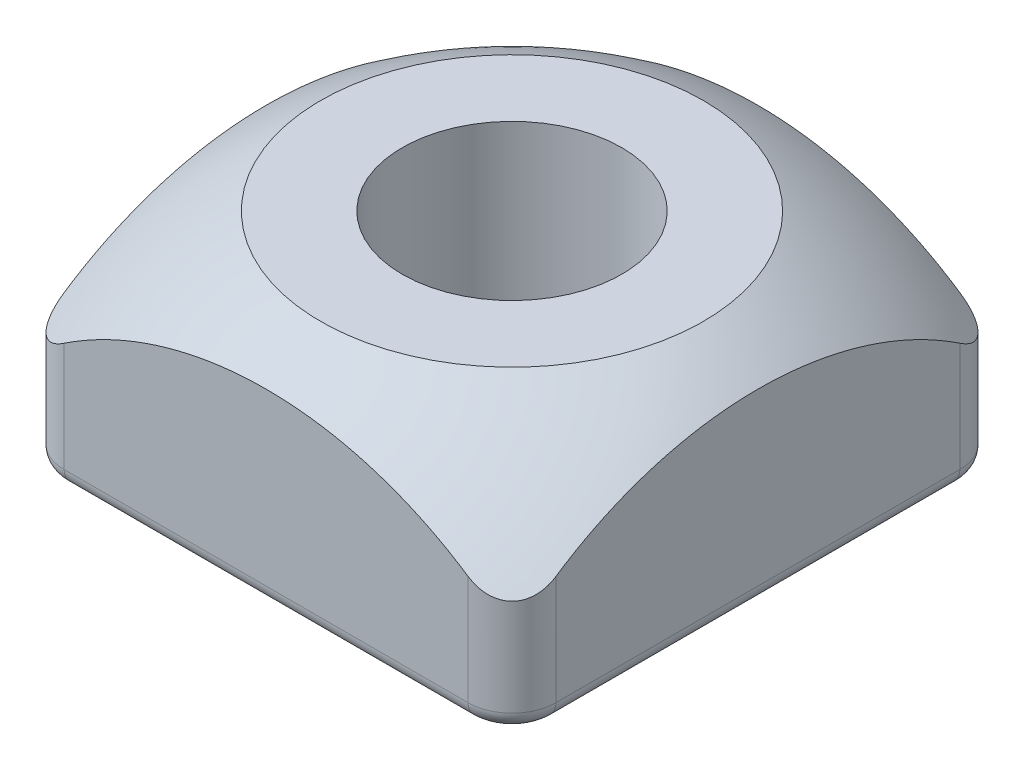
ISO-10303-21;
HEADER;
FILE_DESCRIPTION(('STEP AP214'),'2;1');
FILE_NAME('part.step','',(''),(''),'','','');
FILE_SCHEMA(('AUTOMOTIVE_DESIGN { 1 0 10303 214 1 1 1 1 }'));
ENDSEC;
DATA;
#1=APPLICATION_CONTEXT('core data for automotive mechanical design processes');
#2=APPLICATION_PROTOCOL_DEFINITION('international standard','automotive_design',2000,#1);
#3=PRODUCT_CONTEXT('',#1,'mechanical');
#4=PRODUCT('Part','Part','',(#3));
#5=PRODUCT_RELATED_PRODUCT_CATEGORY('part','',(#4));
#6=PRODUCT_DEFINITION_FORMATION('','',#4);
#7=PRODUCT_DEFINITION_CONTEXT('part definition',#1,'design');
#8=PRODUCT_DEFINITION('design','',#6,#7);
#9=PRODUCT_DEFINITION_SHAPE('','',#8);
#10=(LENGTH_UNIT() NAMED_UNIT(*) SI_UNIT(.MILLI.,.METRE.));
#11=(NAMED_UNIT(*) PLANE_ANGLE_UNIT() SI_UNIT($,.RADIAN.));
#12=(NAMED_UNIT(*) SI_UNIT($,.STERADIAN.) SOLID_ANGLE_UNIT());
#13=UNCERTAINTY_MEASURE_WITH_UNIT(LENGTH_MEASURE(1.E-05),#10,'distance_accuracy_value','');
#14=(GEOMETRIC_REPRESENTATION_CONTEXT(3) GLOBAL_UNCERTAINTY_ASSIGNED_CONTEXT((#13)) GLOBAL_UNIT_ASSIGNED_CONTEXT((#10,
#11,#12)) REPRESENTATION_CONTEXT('',''));
#15=CARTESIAN_POINT('',(0.,0.,0.));
#16=DIRECTION('',(0.,0.,1.));
#17=DIRECTION('',(1.,0.,0.));
#18=AXIS2_PLACEMENT_3D('',#15,#16,#17);
#19=CARTESIAN_POINT('',(-2.8,2.5,2.8));
#20=DIRECTION('',(1.,0.,0.));
#21=DIRECTION('',(0.,0.,-1.));
#22=AXIS2_PLACEMENT_3D('',#19,#20,#21);
#23=PLANE('',#22);
#24=DIRECTION('',(0.,1.,0.));
#25=VECTOR('',#24,1.);
#26=CARTESIAN_POINT('',(-2.8,2.5,-2.3));
#27=LINE('',#26,#25);
#28=CARTESIAN_POINT('',(-2.8,1.44528663539044,-2.3));
#29=VERTEX_POINT('',#28);
#30=CARTESIAN_POINT('',(-2.8,0.2,-2.3));
#31=VERTEX_POINT('',#30);
#32=EDGE_CURVE('E261',#29,#31,#27,.F.);
#33=ORIENTED_EDGE('',*,*,#32,.T.);
#34=DIRECTION('',(0.,0.,-1.));
#35=VECTOR('',#34,1.);
#36=CARTESIAN_POINT('',(-2.8,0.2,2.8));
#37=LINE('',#36,#35);
#38=CARTESIAN_POINT('',(-2.8,0.2,2.3));
#39=VERTEX_POINT('',#38);
#40=EDGE_CURVE('E289',#31,#39,#37,.F.);
#41=ORIENTED_EDGE('',*,*,#40,.T.);
#42=DIRECTION('',(0.,1.,0.));
#43=VECTOR('',#42,1.);
#44=CARTESIAN_POINT('',(-2.8,2.5,2.3));
#45=LINE('',#44,#43);
#46=CARTESIAN_POINT('',(-2.8,1.44528663539044,2.3));
#47=VERTEX_POINT('',#46);
#48=EDGE_CURVE('E263',#39,#47,#45,.T.);
#49=ORIENTED_EDGE('',*,*,#48,.T.);
#50=CARTESIAN_POINT('',(-2.8,-2.,0.));
#51=DIRECTION('',(1.,0.,0.));
#52=DIRECTION('',(0.,0.,-1.));
#53=AXIS2_PLACEMENT_3D('',#50,#51,#52);
#54=CIRCLE('',#53,4.14246303544159);
#55=EDGE_CURVE('E145',#29,#47,#54,.T.);
#56=ORIENTED_EDGE('',*,*,#55,.F.);
#57=EDGE_LOOP('',(#33,#41,#49,#56));
#58=FACE_BOUND('',#57,.T.);
#59=ADVANCED_FACE('F47',(#58),#23,.F.);
#60=CARTESIAN_POINT('',(2.8,2.5,2.8));
#61=DIRECTION('',(0.,0.,-1.));
#62=DIRECTION('',(-1.,0.,0.));
#63=AXIS2_PLACEMENT_3D('',#60,#61,#62);
#64=PLANE('',#63);
#65=DIRECTION('',(0.,1.,0.));
#66=VECTOR('',#65,1.);
#67=CARTESIAN_POINT('',(-2.3,2.5,2.8));
#68=LINE('',#67,#66);
#69=CARTESIAN_POINT('',(-2.3,1.44528663539044,2.8));
#70=VERTEX_POINT('',#69);
#71=CARTESIAN_POINT('',(-2.3,0.2,2.8));
#72=VERTEX_POINT('',#71);
#73=EDGE_CURVE('E155',#70,#72,#68,.F.);
#74=ORIENTED_EDGE('',*,*,#73,.T.);
#75=DIRECTION('',(-1.,0.,0.));
#76=VECTOR('',#75,1.);
#77=CARTESIAN_POINT('',(2.8,0.2,2.8));
#78=LINE('',#77,#76);
#79=CARTESIAN_POINT('',(2.3,0.2,2.8));
#80=VERTEX_POINT('',#79);
#81=EDGE_CURVE('E287',#72,#80,#78,.F.);
#82=ORIENTED_EDGE('',*,*,#81,.T.);
#83=DIRECTION('',(0.,1.,0.));
#84=VECTOR('',#83,1.);
#85=CARTESIAN_POINT('',(2.3,2.5,2.8));
#86=LINE('',#85,#84);
#87=CARTESIAN_POINT('',(2.3,1.44528663539044,2.8));
#88=VERTEX_POINT('',#87);
#89=EDGE_CURVE('E157',#80,#88,#86,.T.);
#90=ORIENTED_EDGE('',*,*,#89,.T.);
#91=CARTESIAN_POINT('',(0.,-2.,2.8));
#92=DIRECTION('',(0.,0.,-1.));
#93=DIRECTION('',(-1.,0.,0.));
#94=AXIS2_PLACEMENT_3D('',#91,#92,#93);
#95=CIRCLE('',#94,4.14246303544159);
#96=EDGE_CURVE('E143',#70,#88,#95,.T.);
#97=ORIENTED_EDGE('',*,*,#96,.F.);
#98=EDGE_LOOP('',(#74,#82,#90,#97));
#99=FACE_BOUND('',#98,.T.);
#100=ADVANCED_FACE('F154',(#99),#64,.F.);
#101=CARTESIAN_POINT('',(2.8,2.5,2.8));
#102=DIRECTION('',(-1.,0.,0.));
#103=DIRECTION('',(0.,0.,1.));
#104=AXIS2_PLACEMENT_3D('',#101,#102,#103);
#105=PLANE('',#104);
#106=DIRECTION('',(0.,1.,0.));
#107=VECTOR('',#106,1.);
#108=CARTESIAN_POINT('',(2.8,2.5,2.3));
#109=LINE('',#108,#107);
#110=CARTESIAN_POINT('',(2.8,1.44528663539044,2.3));
#111=VERTEX_POINT('',#110);
#112=CARTESIAN_POINT('',(2.8,0.2,2.3));
#113=VERTEX_POINT('',#112);
#114=EDGE_CURVE('E259',#111,#113,#109,.F.);
#115=ORIENTED_EDGE('',*,*,#114,.T.);
#116=DIRECTION('',(0.,0.,1.));
#117=VECTOR('',#116,1.);
#118=CARTESIAN_POINT('',(2.8,0.2,2.8));
#119=LINE('',#118,#117);
#120=CARTESIAN_POINT('',(2.8,0.2,-2.3));
#121=VERTEX_POINT('',#120);
#122=EDGE_CURVE('E70',#113,#121,#119,.F.);
#123=ORIENTED_EDGE('',*,*,#122,.T.);
#124=DIRECTION('',(0.,1.,0.));
#125=VECTOR('',#124,1.);
#126=CARTESIAN_POINT('',(2.8,2.5,-2.3));
#127=LINE('',#126,#125);
#128=CARTESIAN_POINT('',(2.8,1.44528663539044,-2.3));
#129=VERTEX_POINT('',#128);
#130=EDGE_CURVE('E253',#121,#129,#127,.T.);
#131=ORIENTED_EDGE('',*,*,#130,.T.);
#132=CARTESIAN_POINT('',(2.8,-2.,0.));
#133=DIRECTION('',(-1.,0.,0.));
#134=DIRECTION('',(0.,0.,1.));
#135=AXIS2_PLACEMENT_3D('',#132,#133,#134);
#136=CIRCLE('',#135,4.14246303544159);
#137=EDGE_CURVE('E161',#111,#129,#136,.T.);
#138=ORIENTED_EDGE('',*,*,#137,.F.);
#139=EDGE_LOOP('',(#115,#123,#131,#138));
#140=FACE_BOUND('',#139,.T.);
#141=ADVANCED_FACE('F236',(#140),#105,.F.);
#142=CARTESIAN_POINT('',(2.8,2.5,-2.8));
#143=DIRECTION('',(0.,0.,1.));
#144=DIRECTION('',(1.,0.,0.));
#145=AXIS2_PLACEMENT_3D('',#142,#143,#144);
#146=PLANE('',#145);
#147=DIRECTION('',(0.,1.,0.));
#148=VECTOR('',#147,1.);
#149=CARTESIAN_POINT('',(2.3,2.5,-2.8));
#150=LINE('',#149,#148);
#151=CARTESIAN_POINT('',(2.3,1.44528663539044,-2.8));
#152=VERTEX_POINT('',#151);
#153=CARTESIAN_POINT('',(2.3,0.2,-2.8));
#154=VERTEX_POINT('',#153);
#155=EDGE_CURVE('E267',#152,#154,#150,.F.);
#156=ORIENTED_EDGE('',*,*,#155,.T.);
#157=DIRECTION('',(1.,0.,0.));
#158=VECTOR('',#157,1.);
#159=CARTESIAN_POINT('',(2.8,0.2,-2.8));
#160=LINE('',#159,#158);
#161=CARTESIAN_POINT('',(-2.3,0.2,-2.8));
#162=VERTEX_POINT('',#161);
#163=EDGE_CURVE('E56',#154,#162,#160,.F.);
#164=ORIENTED_EDGE('',*,*,#163,.T.);
#165=DIRECTION('',(0.,1.,0.));
#166=VECTOR('',#165,1.);
#167=CARTESIAN_POINT('',(-2.3,2.5,-2.8));
#168=LINE('',#167,#166);
#169=CARTESIAN_POINT('',(-2.3,1.44528663539044,-2.8));
#170=VERTEX_POINT('',#169);
#171=EDGE_CURVE('E265',#162,#170,#168,.T.);
#172=ORIENTED_EDGE('',*,*,#171,.T.);
#173=CARTESIAN_POINT('',(0.,-2.,-2.8));
#174=DIRECTION('',(0.,0.,1.));
#175=DIRECTION('',(1.,0.,0.));
#176=AXIS2_PLACEMENT_3D('',#173,#174,#175);
#177=CIRCLE('',#176,4.14246303544159);
#178=EDGE_CURVE('E160',#152,#170,#177,.T.);
#179=ORIENTED_EDGE('',*,*,#178,.F.);
#180=EDGE_LOOP('',(#156,#164,#172,#179));
#181=FACE_BOUND('',#180,.T.);
#182=ADVANCED_FACE('F462',(#181),#146,.F.);
#183=CARTESIAN_POINT('',(0.,2.5,0.));
#184=DIRECTION('',(0.,1.,0.));
#185=DIRECTION('',(0.,0.,1.));
#186=AXIS2_PLACEMENT_3D('',#183,#184,#185);
#187=PLANE('',#186);
#188=CARTESIAN_POINT('',(0.,2.5,0.));
#189=DIRECTION('',(0.,-1.,0.));
#190=DIRECTION('',(0.,0.,-1.));
#191=AXIS2_PLACEMENT_3D('',#188,#189,#190);
#192=CIRCLE('',#191,1.24999999999999);
#193=CARTESIAN_POINT('',(0.,2.5,-1.24999999999999));
#194=VERTEX_POINT('',#193);
#195=EDGE_CURVE('E321',#194,#194,#192,.T.);
#196=ORIENTED_EDGE('',*,*,#195,.T.);
#197=EDGE_LOOP('',(#196));
#198=FACE_BOUND('',#197,.T.);
#199=CARTESIAN_POINT('',(0.,2.5,0.));
#200=DIRECTION('',(0.,-1.,0.));
#201=DIRECTION('',(0.,0.,-1.));
#202=AXIS2_PLACEMENT_3D('',#199,#200,#201);
#203=CIRCLE('',#202,2.17944947177034);
#204=CARTESIAN_POINT('',(0.,2.5,-2.17944947177034));
#205=VERTEX_POINT('',#204);
#206=EDGE_CURVE('E326',#205,#205,#203,.T.);
#207=ORIENTED_EDGE('',*,*,#206,.F.);
#208=EDGE_LOOP('',(#207));
#209=FACE_BOUND('',#208,.T.);
#210=ADVANCED_FACE('F476',(#198,#209),#187,.T.);
#211=CARTESIAN_POINT('',(0.,-2.,0.));
#212=DIRECTION('',(0.,-1.,0.));
#213=DIRECTION('',(-1.,0.,0.));
#214=AXIS2_PLACEMENT_3D('',#211,#212,#213);
#215=SPHERICAL_SURFACE('',#214,5.);
#216=ORIENTED_EDGE('',*,*,#96,.T.);
#217=CARTESIAN_POINT('',(2.3,1.44528663539044,2.8));
#218=CARTESIAN_POINT('',(2.32389359725435,1.42933958153023,2.80000165895995));
#219=CARTESIAN_POINT('',(2.34836510803107,1.41403368764153,2.79828407998937));
#220=CARTESIAN_POINT('',(2.39812554004884,1.3853438352269,2.7909280072133));
#221=CARTESIAN_POINT('',(2.42341990628143,1.37197883051124,2.78525362782335));
#222=CARTESIAN_POINT('',(2.46899510909595,1.35050350313217,2.77105264297867));
#223=CARTESIAN_POINT('',(2.48927254944037,1.34187675888602,2.76331774108007));
#224=CARTESIAN_POINT('',(2.52928038952523,1.32700191940263,2.7448746651823));
#225=CARTESIAN_POINT('',(2.54901238083583,1.32074602832124,2.7341764396475));
#226=CARTESIAN_POINT('',(2.58750775871995,1.3110146308646,2.70971109185568));
#227=CARTESIAN_POINT('',(2.60626093727182,1.30756441903974,2.6959174504787));
#228=CARTESIAN_POINT('',(2.64183331135255,1.30387866373953,2.66564268820175));
#229=CARTESIAN_POINT('',(2.65865242937235,1.30364324905534,2.64916145965846));
#230=CARTESIAN_POINT('',(2.68769297476113,1.30622983881792,2.61640378531577));
#231=CARTESIAN_POINT('',(2.70022729277496,1.30866485215151,2.60037048452868));
#232=CARTESIAN_POINT('',(2.72305241876439,1.31580315380173,2.56726541690732));
#233=CARTESIAN_POINT('',(2.73334390460875,1.32050575538308,2.5501939658421));
#234=CARTESIAN_POINT('',(2.75188517444051,1.3320471112171,2.51496177736431));
#235=CARTESIAN_POINT('',(2.7600632686286,1.3389465355861,2.49678370029081));
#236=CARTESIAN_POINT('',(2.77403958329794,1.35446939746574,2.4602203116725));
#237=CARTESIAN_POINT('',(2.77983306810354,1.36309621547004,2.44183466154758));
#238=CARTESIAN_POINT('',(2.78986169901074,1.38308201829933,2.40250109296047));
#239=CARTESIAN_POINT('',(2.7937418614401,1.39465625733277,2.38157444174607));
#240=CARTESIAN_POINT('',(2.79880266262894,1.41909964886847,2.34030825314171));
#241=CARTESIAN_POINT('',(2.79999848070943,1.43196108831276,2.31996605987963));
#242=CARTESIAN_POINT('',(2.8,1.44528663539044,2.3));
#243=B_SPLINE_CURVE_WITH_KNOTS('',3,(#217,#218,#219,#220,#221,#222,#223,#224,#225,#226,#227,
#228,#229,#230,#231,#232,#233,#234,#235,#236,#237,#238,#239,#240,#241,#242),.UNSPECIFIED.,.F.,
.F.,(4,2,2,2,2,2,2,2,2,2,2,2,4),(0.,0.0863152448825878,0.173423669988819,0.243207755587152,
0.312760343894302,0.382933239318148,0.45310894599913,0.514313904285934,0.575500338384604,
0.638549387743397,0.701723051120375,0.774197114745059,0.846260311432706),.UNSPECIFIED.);
#244=EDGE_CURVE('E149',#88,#111,#243,.T.);
#245=ORIENTED_EDGE('',*,*,#244,.T.);
#246=ORIENTED_EDGE('',*,*,#137,.T.);
#247=CARTESIAN_POINT('',(2.8,1.44528663539044,-2.3));
#248=CARTESIAN_POINT('',(2.80000165895995,1.42933958153023,-2.32389359725435));
#249=CARTESIAN_POINT('',(2.79828407998937,1.41403368764153,-2.34836510803107));
#250=CARTESIAN_POINT('',(2.7909280072133,1.3853438352269,-2.39812554004884));
#251=CARTESIAN_POINT('',(2.78525362782335,1.37197883051124,-2.42341990628143));
#252=CARTESIAN_POINT('',(2.77105264297867,1.35050350313217,-2.46899510909595));
#253=CARTESIAN_POINT('',(2.76331774108007,1.34187675888602,-2.48927254944037));
#254=CARTESIAN_POINT('',(2.7448746651823,1.32700191940263,-2.52928038952523));
#255=CARTESIAN_POINT('',(2.7341764396475,1.32074602832123,-2.54901238083583));
#256=CARTESIAN_POINT('',(2.70971109185568,1.3110146308646,-2.58750775871995));
#257=CARTESIAN_POINT('',(2.6959174504787,1.30756441903974,-2.60626093727182));
#258=CARTESIAN_POINT('',(2.66564268820175,1.30387866373953,-2.64183331135255));
#259=CARTESIAN_POINT('',(2.64916145965846,1.30364324905534,-2.65865242937235));
#260=CARTESIAN_POINT('',(2.61640378531577,1.30622983881792,-2.68769297476113));
#261=CARTESIAN_POINT('',(2.60037048452868,1.30866485215151,-2.70022729277496));
#262=CARTESIAN_POINT('',(2.56726541690732,1.31580315380173,-2.72305241876439));
#263=CARTESIAN_POINT('',(2.5501939658421,1.32050575538308,-2.73334390460875));
#264=CARTESIAN_POINT('',(2.51496177736431,1.3320471112171,-2.75188517444051));
#265=CARTESIAN_POINT('',(2.49678370029081,1.3389465355861,-2.7600632686286));
#266=CARTESIAN_POINT('',(2.4602203116725,1.35446939746574,-2.77403958329794));
#267=CARTESIAN_POINT('',(2.44183466154758,1.36309621547004,-2.77983306810354));
#268=CARTESIAN_POINT('',(2.40250109296047,1.38308201829933,-2.78986169901074));
#269=CARTESIAN_POINT('',(2.38157444174607,1.39465625733277,-2.7937418614401));
#270=CARTESIAN_POINT('',(2.34030825314171,1.41909964886847,-2.79880266262894));
#271=CARTESIAN_POINT('',(2.31996605987963,1.43196108831276,-2.79999848070943));
#272=CARTESIAN_POINT('',(2.3,1.44528663539044,-2.8));
#273=B_SPLINE_CURVE_WITH_KNOTS('',3,(#247,#248,#249,#250,#251,#252,#253,#254,#255,#256,#257,
#258,#259,#260,#261,#262,#263,#264,#265,#266,#267,#268,#269,#270,#271,#272),.UNSPECIFIED.,.F.,
.F.,(4,2,2,2,2,2,2,2,2,2,2,2,4),(0.,0.0863152448825873,0.173423669988819,0.243207755587152,
0.312760343894301,0.382933239318147,0.453108945999129,0.514313904285933,0.575500338384603,
0.638549387743396,0.701723051120374,0.774197114745059,0.846260311432707),.UNSPECIFIED.);
#274=EDGE_CURVE('E150',#129,#152,#273,.T.);
#275=ORIENTED_EDGE('',*,*,#274,.T.);
#276=ORIENTED_EDGE('',*,*,#178,.T.);
#277=CARTESIAN_POINT('',(-2.3,1.44528663539044,-2.8));
#278=CARTESIAN_POINT('',(-2.32389359725435,1.42933958153023,-2.80000165895995));
#279=CARTESIAN_POINT('',(-2.34836510803107,1.41403368764153,-2.79828407998937));
#280=CARTESIAN_POINT('',(-2.39812554004884,1.3853438352269,-2.7909280072133));
#281=CARTESIAN_POINT('',(-2.42341990628143,1.37197883051123,-2.78525362782335));
#282=CARTESIAN_POINT('',(-2.46899510909595,1.35050350313216,-2.77105264297867));
#283=CARTESIAN_POINT('',(-2.48927254944037,1.34187675888602,-2.76331774108007));
#284=CARTESIAN_POINT('',(-2.52928038952523,1.32700191940263,-2.7448746651823));
#285=CARTESIAN_POINT('',(-2.54901238083583,1.32074602832123,-2.7341764396475));
#286=CARTESIAN_POINT('',(-2.58750775871995,1.3110146308646,-2.70971109185568));
#287=CARTESIAN_POINT('',(-2.60626093727182,1.30756441903974,-2.6959174504787));
#288=CARTESIAN_POINT('',(-2.64183331135255,1.30387866373953,-2.66564268820175));
#289=CARTESIAN_POINT('',(-2.65865242937235,1.30364324905534,-2.64916145965846));
#290=CARTESIAN_POINT('',(-2.68769297476113,1.30622983881792,-2.61640378531577));
#291=CARTESIAN_POINT('',(-2.70022729277496,1.30866485215151,-2.60037048452868));
#292=CARTESIAN_POINT('',(-2.72305241876439,1.31580315380173,-2.56726541690732));
#293=CARTESIAN_POINT('',(-2.73334390460875,1.32050575538307,-2.5501939658421));
#294=CARTESIAN_POINT('',(-2.75188517444051,1.3320471112171,-2.51496177736431));
#295=CARTESIAN_POINT('',(-2.7600632686286,1.3389465355861,-2.49678370029081));
#296=CARTESIAN_POINT('',(-2.77403958329794,1.35446939746574,-2.4602203116725));
#297=CARTESIAN_POINT('',(-2.77983306810354,1.36309621547004,-2.44183466154758));
#298=CARTESIAN_POINT('',(-2.78986169901074,1.38308201829933,-2.40250109296047));
#299=CARTESIAN_POINT('',(-2.7937418614401,1.39465625733277,-2.38157444174607));
#300=CARTESIAN_POINT('',(-2.79880266262894,1.41909964886847,-2.3403082531417));
#301=CARTESIAN_POINT('',(-2.79999848070943,1.43196108831276,-2.31996605987963));
#302=CARTESIAN_POINT('',(-2.8,1.44528663539044,-2.3));
#303=B_SPLINE_CURVE_WITH_KNOTS('',3,(#277,#278,#279,#280,#281,#282,#283,#284,#285,#286,#287,
#288,#289,#290,#291,#292,#293,#294,#295,#296,#297,#298,#299,#300,#301,#302),.UNSPECIFIED.,.F.,
.F.,(4,2,2,2,2,2,2,2,2,2,2,2,4),(0.,0.0863152448825873,0.173423669988819,0.243207755587152,
0.312760343894301,0.382933239318147,0.453108945999129,0.514313904285933,0.575500338384603,
0.638549387743396,0.701723051120374,0.774197114745059,0.846260311432707),.UNSPECIFIED.);
#304=EDGE_CURVE('E168',#170,#29,#303,.T.);
#305=ORIENTED_EDGE('',*,*,#304,.T.);
#306=ORIENTED_EDGE('',*,*,#55,.T.);
#307=CARTESIAN_POINT('',(-2.8,1.44528663539044,2.3));
#308=CARTESIAN_POINT('',(-2.80000165895995,1.42933958153023,2.32389359725435));
#309=CARTESIAN_POINT('',(-2.79828407998937,1.41403368764153,2.34836510803107));
#310=CARTESIAN_POINT('',(-2.7909280072133,1.3853438352269,2.39812554004884));
#311=CARTESIAN_POINT('',(-2.78525362782335,1.37197883051123,2.42341990628143));
#312=CARTESIAN_POINT('',(-2.77105264297867,1.35050350313216,2.46899510909595));
#313=CARTESIAN_POINT('',(-2.76331774108007,1.34187675888602,2.48927254944037));
#314=CARTESIAN_POINT('',(-2.7448746651823,1.32700191940263,2.52928038952523));
#315=CARTESIAN_POINT('',(-2.7341764396475,1.32074602832123,2.54901238083583));
#316=CARTESIAN_POINT('',(-2.70971109185568,1.3110146308646,2.58750775871995));
#317=CARTESIAN_POINT('',(-2.6959174504787,1.30756441903973,2.60626093727182));
#318=CARTESIAN_POINT('',(-2.66564268820175,1.30387866373953,2.64183331135255));
#319=CARTESIAN_POINT('',(-2.64916145965846,1.30364324905534,2.65865242937235));
#320=CARTESIAN_POINT('',(-2.61640378531577,1.30622983881792,2.68769297476113));
#321=CARTESIAN_POINT('',(-2.60037048452868,1.30866485215151,2.70022729277496));
#322=CARTESIAN_POINT('',(-2.56726541690733,1.31580315380173,2.72305241876439));
#323=CARTESIAN_POINT('',(-2.5501939658421,1.32050575538307,2.73334390460875));
#324=CARTESIAN_POINT('',(-2.51496177736431,1.3320471112171,2.75188517444051));
#325=CARTESIAN_POINT('',(-2.49678370029081,1.3389465355861,2.7600632686286));
#326=CARTESIAN_POINT('',(-2.4602203116725,1.35446939746573,2.77403958329794));
#327=CARTESIAN_POINT('',(-2.44183466154758,1.36309621547004,2.77983306810354));
#328=CARTESIAN_POINT('',(-2.40250109296047,1.38308201829933,2.78986169901074));
#329=CARTESIAN_POINT('',(-2.38157444174607,1.39465625733276,2.7937418614401));
#330=CARTESIAN_POINT('',(-2.34030825314171,1.41909964886847,2.79880266262894));
#331=CARTESIAN_POINT('',(-2.31996605987963,1.43196108831276,2.79999848070943));
#332=CARTESIAN_POINT('',(-2.3,1.44528663539044,2.8));
#333=B_SPLINE_CURVE_WITH_KNOTS('',3,(#307,#308,#309,#310,#311,#312,#313,#314,#315,#316,#317,
#318,#319,#320,#321,#322,#323,#324,#325,#326,#327,#328,#329,#330,#331,#332),.UNSPECIFIED.,.F.,
.F.,(4,2,2,2,2,2,2,2,2,2,2,2,4),(0.,0.0863152448825876,0.17342366998882,0.243207755587151,
0.312760343894302,0.382933239318148,0.453108945999129,0.514313904285933,0.575500338384604,
0.638549387743397,0.701723051120375,0.774197114745059,0.846260311432707),.UNSPECIFIED.);
#334=EDGE_CURVE('E139',#47,#70,#333,.T.);
#335=ORIENTED_EDGE('',*,*,#334,.T.);
#336=EDGE_LOOP('',(#216,#245,#246,#275,#276,#305,#306,#335));
#337=FACE_BOUND('',#336,.T.);
#338=ORIENTED_EDGE('',*,*,#206,.T.);
#339=EDGE_LOOP('',(#338));
#340=FACE_BOUND('',#339,.T.);
#341=ADVANCED_FACE('F141',(#337,#340),#215,.T.);
#342=CARTESIAN_POINT('',(0.,0.,0.));
#343=DIRECTION('',(0.,1.,0.));
#344=DIRECTION('',(0.,0.,1.));
#345=AXIS2_PLACEMENT_3D('',#342,#343,#344);
#346=PLANE('',#345);
#347=DIRECTION('',(-1.,0.,0.));
#348=VECTOR('',#347,1.);
#349=CARTESIAN_POINT('',(0.,0.,2.6));
#350=LINE('',#349,#348);
#351=CARTESIAN_POINT('',(2.3,0.,2.6));
#352=VERTEX_POINT('',#351);
#353=CARTESIAN_POINT('',(-2.3,0.,2.6));
#354=VERTEX_POINT('',#353);
#355=EDGE_CURVE('E281',#352,#354,#350,.T.);
#356=ORIENTED_EDGE('',*,*,#355,.T.);
#357=CARTESIAN_POINT('',(-2.3,0.,2.3));
#358=DIRECTION('',(0.,1.,0.));
#359=DIRECTION('',(0.,0.,1.));
#360=AXIS2_PLACEMENT_3D('',#357,#358,#359);
#361=CIRCLE('',#360,0.3);
#362=CARTESIAN_POINT('',(-2.6,0.,2.3));
#363=VERTEX_POINT('',#362);
#364=EDGE_CURVE('E283',#354,#363,#361,.F.);
#365=ORIENTED_EDGE('',*,*,#364,.T.);
#366=DIRECTION('',(0.,0.,-1.));
#367=VECTOR('',#366,1.);
#368=CARTESIAN_POINT('',(-2.6,0.,0.));
#369=LINE('',#368,#367);
#370=CARTESIAN_POINT('',(-2.6,0.,-2.3));
#371=VERTEX_POINT('',#370);
#372=EDGE_CURVE('E279',#363,#371,#369,.T.);
#373=ORIENTED_EDGE('',*,*,#372,.T.);
#374=CARTESIAN_POINT('',(-2.3,0.,-2.3));
#375=DIRECTION('',(0.,1.,0.));
#376=DIRECTION('',(0.,0.,1.));
#377=AXIS2_PLACEMENT_3D('',#374,#375,#376);
#378=CIRCLE('',#377,0.3);
#379=CARTESIAN_POINT('',(-2.3,0.,-2.6));
#380=VERTEX_POINT('',#379);
#381=EDGE_CURVE('E275',#371,#380,#378,.F.);
#382=ORIENTED_EDGE('',*,*,#381,.T.);
#383=DIRECTION('',(1.,0.,0.));
#384=VECTOR('',#383,1.);
#385=CARTESIAN_POINT('',(0.,0.,-2.6));
#386=LINE('',#385,#384);
#387=CARTESIAN_POINT('',(2.3,0.,-2.6));
#388=VERTEX_POINT('',#387);
#389=EDGE_CURVE('E271',#380,#388,#386,.T.);
#390=ORIENTED_EDGE('',*,*,#389,.T.);
#391=CARTESIAN_POINT('',(2.3,0.,-2.3));
#392=DIRECTION('',(0.,1.,0.));
#393=DIRECTION('',(0.,0.,1.));
#394=AXIS2_PLACEMENT_3D('',#391,#392,#393);
#395=CIRCLE('',#394,0.3);
#396=CARTESIAN_POINT('',(2.6,0.,-2.3));
#397=VERTEX_POINT('',#396);
#398=EDGE_CURVE('E269',#388,#397,#395,.F.);
#399=ORIENTED_EDGE('',*,*,#398,.T.);
#400=DIRECTION('',(0.,0.,1.));
#401=VECTOR('',#400,1.);
#402=CARTESIAN_POINT('',(2.6,0.,0.));
#403=LINE('',#402,#401);
#404=CARTESIAN_POINT('',(2.6,0.,2.3));
#405=VERTEX_POINT('',#404);
#406=EDGE_CURVE('E273',#397,#405,#403,.T.);
#407=ORIENTED_EDGE('',*,*,#406,.T.);
#408=CARTESIAN_POINT('',(2.3,0.,2.3));
#409=DIRECTION('',(0.,1.,0.));
#410=DIRECTION('',(0.,0.,1.));
#411=AXIS2_PLACEMENT_3D('',#408,#409,#410);
#412=CIRCLE('',#411,0.3);
#413=EDGE_CURVE('E277',#405,#352,#412,.F.);
#414=ORIENTED_EDGE('',*,*,#413,.T.);
#415=EDGE_LOOP('',(#356,#365,#373,#382,#390,#399,#407,#414));
#416=FACE_BOUND('',#415,.T.);
#417=CARTESIAN_POINT('',(0.,0.,0.));
#418=DIRECTION('',(0.,-1.,0.));
#419=DIRECTION('',(0.,0.,-1.));
#420=AXIS2_PLACEMENT_3D('',#417,#418,#419);
#421=CIRCLE('',#420,1.24999999999999);
#422=CARTESIAN_POINT('',(0.,0.,-1.24999999999999));
#423=VERTEX_POINT('',#422);
#424=EDGE_CURVE('E317',#423,#423,#421,.T.);
#425=ORIENTED_EDGE('',*,*,#424,.F.);
#426=EDGE_LOOP('',(#425));
#427=FACE_BOUND('',#426,.T.);
#428=ADVANCED_FACE('F475',(#416,#427),#346,.F.);
#429=CARTESIAN_POINT('',(0.,0.,0.));
#430=DIRECTION('',(0.,-1.,0.));
#431=DIRECTION('',(0.,0.,-1.));
#432=AXIS2_PLACEMENT_3D('',#429,#430,#431);
#433=CYLINDRICAL_SURFACE('',#432,1.24999999999999);
#434=ORIENTED_EDGE('',*,*,#195,.F.);
#435=EDGE_LOOP('',(#434));
#436=FACE_BOUND('',#435,.T.);
#437=ORIENTED_EDGE('',*,*,#424,.T.);
#438=EDGE_LOOP('',(#437));
#439=FACE_BOUND('',#438,.T.);
#440=ADVANCED_FACE('F244',(#436,#439),#433,.F.);
#441=CARTESIAN_POINT('',(2.3,2.5,2.3));
#442=DIRECTION('',(0.,1.,0.));
#443=DIRECTION('',(0.,0.,1.));
#444=AXIS2_PLACEMENT_3D('',#441,#442,#443);
#445=CYLINDRICAL_SURFACE('',#444,0.5);
#446=ORIENTED_EDGE('',*,*,#89,.F.);
#447=CARTESIAN_POINT('',(2.3,0.2,2.3));
#448=DIRECTION('',(0.,1.,0.));
#449=DIRECTION('',(0.,0.,1.));
#450=AXIS2_PLACEMENT_3D('',#447,#448,#449);
#451=CIRCLE('',#450,0.5);
#452=EDGE_CURVE('E291',#80,#113,#451,.T.);
#453=ORIENTED_EDGE('',*,*,#452,.T.);
#454=ORIENTED_EDGE('',*,*,#114,.F.);
#455=ORIENTED_EDGE('',*,*,#244,.F.);
#456=EDGE_LOOP('',(#446,#453,#454,#455));
#457=FACE_BOUND('',#456,.T.);
#458=ADVANCED_FACE('F241',(#457),#445,.T.);
#459=CARTESIAN_POINT('',(-2.3,2.5,2.3));
#460=DIRECTION('',(0.,1.,0.));
#461=DIRECTION('',(0.,0.,1.));
#462=AXIS2_PLACEMENT_3D('',#459,#460,#461);
#463=CYLINDRICAL_SURFACE('',#462,0.5);
#464=ORIENTED_EDGE('',*,*,#48,.F.);
#465=CARTESIAN_POINT('',(-2.3,0.2,2.3));
#466=DIRECTION('',(0.,1.,0.));
#467=DIRECTION('',(0.,0.,1.));
#468=AXIS2_PLACEMENT_3D('',#465,#466,#467);
#469=CIRCLE('',#468,0.5);
#470=EDGE_CURVE('E166',#39,#72,#469,.T.);
#471=ORIENTED_EDGE('',*,*,#470,.T.);
#472=ORIENTED_EDGE('',*,*,#73,.F.);
#473=ORIENTED_EDGE('',*,*,#334,.F.);
#474=EDGE_LOOP('',(#464,#471,#472,#473));
#475=FACE_BOUND('',#474,.T.);
#476=ADVANCED_FACE('F164',(#475),#463,.T.);
#477=CARTESIAN_POINT('',(2.3,2.5,-2.3));
#478=DIRECTION('',(0.,1.,0.));
#479=DIRECTION('',(0.,0.,1.));
#480=AXIS2_PLACEMENT_3D('',#477,#478,#479);
#481=CYLINDRICAL_SURFACE('',#480,0.5);
#482=ORIENTED_EDGE('',*,*,#130,.F.);
#483=CARTESIAN_POINT('',(2.3,0.2,-2.3));
#484=DIRECTION('',(0.,1.,0.));
#485=DIRECTION('',(0.,0.,1.));
#486=AXIS2_PLACEMENT_3D('',#483,#484,#485);
#487=CIRCLE('',#486,0.5);
#488=EDGE_CURVE('E13',#121,#154,#487,.T.);
#489=ORIENTED_EDGE('',*,*,#488,.T.);
#490=ORIENTED_EDGE('',*,*,#155,.F.);
#491=ORIENTED_EDGE('',*,*,#274,.F.);
#492=EDGE_LOOP('',(#482,#489,#490,#491));
#493=FACE_BOUND('',#492,.T.);
#494=ADVANCED_FACE('F194',(#493),#481,.T.);
#495=CARTESIAN_POINT('',(-2.3,2.5,-2.3));
#496=DIRECTION('',(0.,1.,0.));
#497=DIRECTION('',(0.,0.,1.));
#498=AXIS2_PLACEMENT_3D('',#495,#496,#497);
#499=CYLINDRICAL_SURFACE('',#498,0.5);
#500=ORIENTED_EDGE('',*,*,#171,.F.);
#501=CARTESIAN_POINT('',(-2.3,0.2,-2.3));
#502=DIRECTION('',(0.,1.,0.));
#503=DIRECTION('',(0.,0.,1.));
#504=AXIS2_PLACEMENT_3D('',#501,#502,#503);
#505=CIRCLE('',#504,0.5);
#506=EDGE_CURVE('E293',#162,#31,#505,.T.);
#507=ORIENTED_EDGE('',*,*,#506,.T.);
#508=ORIENTED_EDGE('',*,*,#32,.F.);
#509=ORIENTED_EDGE('',*,*,#304,.F.);
#510=EDGE_LOOP('',(#500,#507,#508,#509));
#511=FACE_BOUND('',#510,.T.);
#512=ADVANCED_FACE('F190',(#511),#499,.T.);
#513=CARTESIAN_POINT('',(2.3,0.2,-2.3));
#514=DIRECTION('',(0.,1.,0.));
#515=DIRECTION('',(0.,0.,1.));
#516=AXIS2_PLACEMENT_3D('',#513,#514,#515);
#517=TOROIDAL_SURFACE('',#516,0.3,0.2);
#518=CARTESIAN_POINT('',(2.3,0.2,-2.6));
#519=DIRECTION('',(-1.,0.,0.));
#520=DIRECTION('',(0.,0.,1.));
#521=AXIS2_PLACEMENT_3D('',#518,#519,#520);
#522=CIRCLE('',#521,0.2);
#523=EDGE_CURVE('E312',#154,#388,#522,.T.);
#524=ORIENTED_EDGE('',*,*,#523,.F.);
#525=ORIENTED_EDGE('',*,*,#488,.F.);
#526=CARTESIAN_POINT('',(2.6,0.2,-2.3));
#527=DIRECTION('',(0.,0.,1.));
#528=DIRECTION('',(1.,0.,0.));
#529=AXIS2_PLACEMENT_3D('',#526,#527,#528);
#530=CIRCLE('',#529,0.2);
#531=EDGE_CURVE('E51',#397,#121,#530,.T.);
#532=ORIENTED_EDGE('',*,*,#531,.F.);
#533=ORIENTED_EDGE('',*,*,#398,.F.);
#534=EDGE_LOOP('',(#524,#525,#532,#533));
#535=FACE_BOUND('',#534,.T.);
#536=ADVANCED_FACE('F49',(#535),#517,.T.);
#537=CARTESIAN_POINT('',(2.6,0.2,0.));
#538=DIRECTION('',(0.,0.,1.));
#539=DIRECTION('',(1.,0.,0.));
#540=AXIS2_PLACEMENT_3D('',#537,#538,#539);
#541=CYLINDRICAL_SURFACE('',#540,0.2);
#542=ORIENTED_EDGE('',*,*,#531,.T.);
#543=ORIENTED_EDGE('',*,*,#122,.F.);
#544=CARTESIAN_POINT('',(2.6,0.2,2.3));
#545=DIRECTION('',(0.,0.,1.));
#546=DIRECTION('',(1.,0.,0.));
#547=AXIS2_PLACEMENT_3D('',#544,#545,#546);
#548=CIRCLE('',#547,0.2);
#549=EDGE_CURVE('E310',#405,#113,#548,.T.);
#550=ORIENTED_EDGE('',*,*,#549,.F.);
#551=ORIENTED_EDGE('',*,*,#406,.F.);
#552=EDGE_LOOP('',(#542,#543,#550,#551));
#553=FACE_BOUND('',#552,.T.);
#554=ADVANCED_FACE('F220',(#553),#541,.T.);
#555=CARTESIAN_POINT('',(0.,0.2,-2.6));
#556=DIRECTION('',(1.,0.,0.));
#557=DIRECTION('',(0.,0.,-1.));
#558=AXIS2_PLACEMENT_3D('',#555,#556,#557);
#559=CYLINDRICAL_SURFACE('',#558,0.2);
#560=ORIENTED_EDGE('',*,*,#523,.T.);
#561=ORIENTED_EDGE('',*,*,#389,.F.);
#562=CARTESIAN_POINT('',(-2.3,0.2,-2.6));
#563=DIRECTION('',(-1.,0.,0.));
#564=DIRECTION('',(0.,0.,1.));
#565=AXIS2_PLACEMENT_3D('',#562,#563,#564);
#566=CIRCLE('',#565,0.2);
#567=EDGE_CURVE('E307',#162,#380,#566,.T.);
#568=ORIENTED_EDGE('',*,*,#567,.F.);
#569=ORIENTED_EDGE('',*,*,#163,.F.);
#570=EDGE_LOOP('',(#560,#561,#568,#569));
#571=FACE_BOUND('',#570,.T.);
#572=ADVANCED_FACE('F217',(#571),#559,.T.);
#573=CARTESIAN_POINT('',(2.3,0.2,2.3));
#574=DIRECTION('',(0.,1.,0.));
#575=DIRECTION('',(0.,0.,1.));
#576=AXIS2_PLACEMENT_3D('',#573,#574,#575);
#577=TOROIDAL_SURFACE('',#576,0.3,0.2);
#578=ORIENTED_EDGE('',*,*,#549,.T.);
#579=ORIENTED_EDGE('',*,*,#452,.F.);
#580=CARTESIAN_POINT('',(2.3,0.2,2.6));
#581=DIRECTION('',(-1.,0.,0.));
#582=DIRECTION('',(0.,0.,1.));
#583=AXIS2_PLACEMENT_3D('',#580,#581,#582);
#584=CIRCLE('',#583,0.2);
#585=EDGE_CURVE('E304',#352,#80,#584,.T.);
#586=ORIENTED_EDGE('',*,*,#585,.F.);
#587=ORIENTED_EDGE('',*,*,#413,.F.);
#588=EDGE_LOOP('',(#578,#579,#586,#587));
#589=FACE_BOUND('',#588,.T.);
#590=ADVANCED_FACE('F213',(#589),#577,.T.);
#591=CARTESIAN_POINT('',(-2.3,0.2,-2.3));
#592=DIRECTION('',(0.,1.,0.));
#593=DIRECTION('',(0.,0.,1.));
#594=AXIS2_PLACEMENT_3D('',#591,#592,#593);
#595=TOROIDAL_SURFACE('',#594,0.3,0.2);
#596=ORIENTED_EDGE('',*,*,#567,.T.);
#597=ORIENTED_EDGE('',*,*,#381,.F.);
#598=CARTESIAN_POINT('',(-2.6,0.2,-2.3));
#599=DIRECTION('',(0.,0.,1.));
#600=DIRECTION('',(1.,0.,0.));
#601=AXIS2_PLACEMENT_3D('',#598,#599,#600);
#602=CIRCLE('',#601,0.2);
#603=EDGE_CURVE('E301',#31,#371,#602,.T.);
#604=ORIENTED_EDGE('',*,*,#603,.F.);
#605=ORIENTED_EDGE('',*,*,#506,.F.);
#606=EDGE_LOOP('',(#596,#597,#604,#605));
#607=FACE_BOUND('',#606,.T.);
#608=ADVANCED_FACE('F209',(#607),#595,.T.);
#609=CARTESIAN_POINT('',(0.,0.2,2.6));
#610=DIRECTION('',(-1.,0.,0.));
#611=DIRECTION('',(0.,0.,1.));
#612=AXIS2_PLACEMENT_3D('',#609,#610,#611);
#613=CYLINDRICAL_SURFACE('',#612,0.2);
#614=ORIENTED_EDGE('',*,*,#585,.T.);
#615=ORIENTED_EDGE('',*,*,#81,.F.);
#616=CARTESIAN_POINT('',(-2.3,0.2,2.6));
#617=DIRECTION('',(-1.,0.,0.));
#618=DIRECTION('',(0.,0.,1.));
#619=AXIS2_PLACEMENT_3D('',#616,#617,#618);
#620=CIRCLE('',#619,0.2);
#621=EDGE_CURVE('E299',#354,#72,#620,.T.);
#622=ORIENTED_EDGE('',*,*,#621,.F.);
#623=ORIENTED_EDGE('',*,*,#355,.F.);
#624=EDGE_LOOP('',(#614,#615,#622,#623));
#625=FACE_BOUND('',#624,.T.);
#626=ADVANCED_FACE('F205',(#625),#613,.T.);
#627=CARTESIAN_POINT('',(-2.6,0.2,0.));
#628=DIRECTION('',(0.,0.,-1.));
#629=DIRECTION('',(-1.,0.,0.));
#630=AXIS2_PLACEMENT_3D('',#627,#628,#629);
#631=CYLINDRICAL_SURFACE('',#630,0.2);
#632=ORIENTED_EDGE('',*,*,#603,.T.);
#633=ORIENTED_EDGE('',*,*,#372,.F.);
#634=CARTESIAN_POINT('',(-2.6,0.2,2.3));
#635=DIRECTION('',(0.,0.,1.));
#636=DIRECTION('',(1.,0.,0.));
#637=AXIS2_PLACEMENT_3D('',#634,#635,#636);
#638=CIRCLE('',#637,0.2);
#639=EDGE_CURVE('E297',#39,#363,#638,.T.);
#640=ORIENTED_EDGE('',*,*,#639,.F.);
#641=ORIENTED_EDGE('',*,*,#40,.F.);
#642=EDGE_LOOP('',(#632,#633,#640,#641));
#643=FACE_BOUND('',#642,.T.);
#644=ADVANCED_FACE('F201',(#643),#631,.T.);
#645=CARTESIAN_POINT('',(-2.3,0.2,2.3));
#646=DIRECTION('',(0.,1.,0.));
#647=DIRECTION('',(0.,0.,1.));
#648=AXIS2_PLACEMENT_3D('',#645,#646,#647);
#649=TOROIDAL_SURFACE('',#648,0.3,0.2);
#650=ORIENTED_EDGE('',*,*,#621,.T.);
#651=ORIENTED_EDGE('',*,*,#470,.F.);
#652=ORIENTED_EDGE('',*,*,#639,.T.);
#653=ORIENTED_EDGE('',*,*,#364,.F.);
#654=EDGE_LOOP('',(#650,#651,#652,#653));
#655=FACE_BOUND('',#654,.T.);
#656=ADVANCED_FACE('F198',(#655),#649,.T.);
#657=CLOSED_SHELL('',(#59,#100,#141,#182,#210,#341,#428,#440,#458,#476,#494,#512,#536,#554,#572,
#590,#608,#626,#644,#656));
#658=MANIFOLD_SOLID_BREP('B2',#657);
#659=ADVANCED_BREP_SHAPE_REPRESENTATION('',(#18,#658),#14);
#660=SHAPE_DEFINITION_REPRESENTATION(#9,#659);
ENDSEC;
END-ISO-10303-21;
